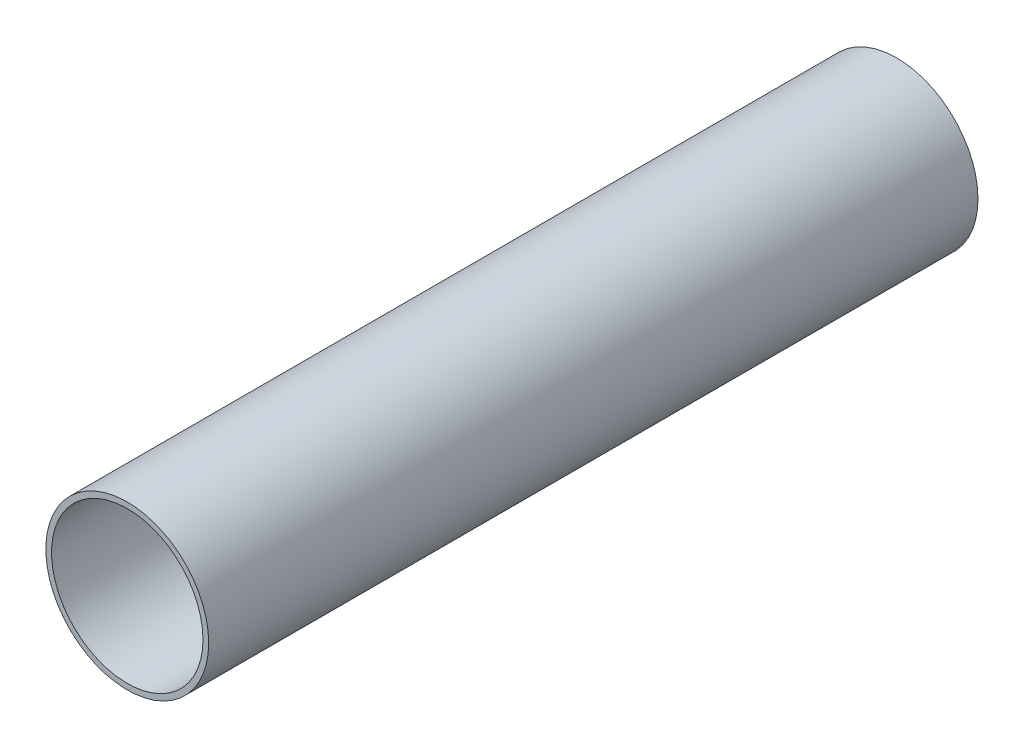
ISO-10303-21;
HEADER;
FILE_DESCRIPTION(('STEP AP214'),'2;1');
FILE_NAME('part.step','',(''),(''),'','','');
FILE_SCHEMA(('AUTOMOTIVE_DESIGN { 1 0 10303 214 1 1 1 1 }'));
ENDSEC;
DATA;
#1=APPLICATION_CONTEXT('core data for automotive mechanical design processes');
#2=APPLICATION_PROTOCOL_DEFINITION('international standard','automotive_design',2000,#1);
#3=PRODUCT_CONTEXT('',#1,'mechanical');
#4=PRODUCT('Part','Part','',(#3));
#5=PRODUCT_RELATED_PRODUCT_CATEGORY('part','',(#4));
#6=PRODUCT_DEFINITION_FORMATION('','',#4);
#7=PRODUCT_DEFINITION_CONTEXT('part definition',#1,'design');
#8=PRODUCT_DEFINITION('design','',#6,#7);
#9=PRODUCT_DEFINITION_SHAPE('','',#8);
#10=(LENGTH_UNIT() NAMED_UNIT(*) SI_UNIT(.MILLI.,.METRE.));
#11=(NAMED_UNIT(*) PLANE_ANGLE_UNIT() SI_UNIT($,.RADIAN.));
#12=(NAMED_UNIT(*) SI_UNIT($,.STERADIAN.) SOLID_ANGLE_UNIT());
#13=UNCERTAINTY_MEASURE_WITH_UNIT(LENGTH_MEASURE(1.E-05),#10,'distance_accuracy_value','');
#14=(GEOMETRIC_REPRESENTATION_CONTEXT(3) GLOBAL_UNCERTAINTY_ASSIGNED_CONTEXT((#13)) GLOBAL_UNIT_ASSIGNED_CONTEXT((#10,
#11,#12)) REPRESENTATION_CONTEXT('',''));
#15=CARTESIAN_POINT('',(0.,0.,0.));
#16=DIRECTION('',(0.,0.,1.));
#17=DIRECTION('',(1.,0.,0.));
#18=AXIS2_PLACEMENT_3D('',#15,#16,#17);
#19=CARTESIAN_POINT('',(0.,0.,270.));
#20=DIRECTION('',(0.,0.,1.));
#21=DIRECTION('',(1.,0.,0.));
#22=AXIS2_PLACEMENT_3D('',#19,#20,#21);
#23=PLANE('',#22);
#24=CARTESIAN_POINT('',(0.,0.,270.));
#25=DIRECTION('',(0.,0.,1.));
#26=DIRECTION('',(1.,0.,0.));
#27=AXIS2_PLACEMENT_3D('',#24,#25,#26);
#28=CIRCLE('',#27,28.575);
#29=CARTESIAN_POINT('',(28.575,0.,270.));
#30=VERTEX_POINT('',#29);
#31=EDGE_CURVE('E10',#30,#30,#28,.T.);
#32=ORIENTED_EDGE('',*,*,#31,.T.);
#33=EDGE_LOOP('',(#32));
#34=FACE_BOUND('',#33,.T.);
#35=CARTESIAN_POINT('',(0.,0.,270.));
#36=DIRECTION('',(0.,0.,1.));
#37=DIRECTION('',(1.,0.,0.));
#38=AXIS2_PLACEMENT_3D('',#35,#36,#37);
#39=CIRCLE('',#38,26.575);
#40=CARTESIAN_POINT('',(26.575,0.,270.));
#41=VERTEX_POINT('',#40);
#42=EDGE_CURVE('E50',#41,#41,#39,.T.);
#43=ORIENTED_EDGE('',*,*,#42,.F.);
#44=EDGE_LOOP('',(#43));
#45=FACE_BOUND('',#44,.T.);
#46=ADVANCED_FACE('F39',(#34,#45),#23,.T.);
#47=CARTESIAN_POINT('',(0.,0.,0.));
#48=DIRECTION('',(0.,0.,1.));
#49=DIRECTION('',(1.,0.,0.));
#50=AXIS2_PLACEMENT_3D('',#47,#48,#49);
#51=PLANE('',#50);
#52=CARTESIAN_POINT('',(0.,0.,0.));
#53=DIRECTION('',(0.,0.,1.));
#54=DIRECTION('',(1.,0.,0.));
#55=AXIS2_PLACEMENT_3D('',#52,#53,#54);
#56=CIRCLE('',#55,28.575);
#57=CARTESIAN_POINT('',(28.575,0.,0.));
#58=VERTEX_POINT('',#57);
#59=EDGE_CURVE('E43',#58,#58,#56,.T.);
#60=ORIENTED_EDGE('',*,*,#59,.F.);
#61=EDGE_LOOP('',(#60));
#62=FACE_BOUND('',#61,.T.);
#63=CARTESIAN_POINT('',(0.,0.,0.));
#64=DIRECTION('',(0.,0.,1.));
#65=DIRECTION('',(1.,0.,0.));
#66=AXIS2_PLACEMENT_3D('',#63,#64,#65);
#67=CIRCLE('',#66,26.575);
#68=CARTESIAN_POINT('',(26.575,0.,0.));
#69=VERTEX_POINT('',#68);
#70=EDGE_CURVE('E52',#69,#69,#67,.T.);
#71=ORIENTED_EDGE('',*,*,#70,.T.);
#72=EDGE_LOOP('',(#71));
#73=FACE_BOUND('',#72,.T.);
#74=ADVANCED_FACE('F62',(#62,#73),#51,.F.);
#75=CARTESIAN_POINT('',(0.,0.,270.));
#76=DIRECTION('',(0.,0.,-1.));
#77=DIRECTION('',(-1.,0.,0.));
#78=AXIS2_PLACEMENT_3D('',#75,#76,#77);
#79=CYLINDRICAL_SURFACE('',#78,28.575);
#80=ORIENTED_EDGE('',*,*,#31,.F.);
#81=EDGE_LOOP('',(#80));
#82=FACE_BOUND('',#81,.T.);
#83=ORIENTED_EDGE('',*,*,#59,.T.);
#84=EDGE_LOOP('',(#83));
#85=FACE_BOUND('',#84,.T.);
#86=ADVANCED_FACE('F41',(#82,#85),#79,.T.);
#87=CARTESIAN_POINT('',(0.,0.,270.));
#88=DIRECTION('',(0.,0.,-1.));
#89=DIRECTION('',(-1.,0.,0.));
#90=AXIS2_PLACEMENT_3D('',#87,#88,#89);
#91=CYLINDRICAL_SURFACE('',#90,26.575);
#92=ORIENTED_EDGE('',*,*,#42,.T.);
#93=EDGE_LOOP('',(#92));
#94=FACE_BOUND('',#93,.T.);
#95=ORIENTED_EDGE('',*,*,#70,.F.);
#96=EDGE_LOOP('',(#95));
#97=FACE_BOUND('',#96,.T.);
#98=ADVANCED_FACE('F58',(#94,#97),#91,.F.);
#99=CLOSED_SHELL('',(#46,#74,#86,#98));
#100=MANIFOLD_SOLID_BREP('B2',#99);
#101=ADVANCED_BREP_SHAPE_REPRESENTATION('',(#18,#100),#14);
#102=SHAPE_DEFINITION_REPRESENTATION(#9,#101);
ENDSEC;
END-ISO-10303-21;
